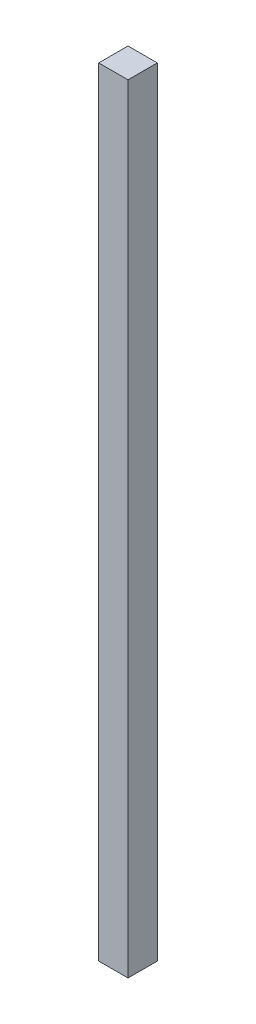
ISO-10303-21;
HEADER;
FILE_DESCRIPTION(('STEP AP214'),'2;1');
FILE_NAME('part.step','',(''),(''),'','','');
FILE_SCHEMA(('AUTOMOTIVE_DESIGN { 1 0 10303 214 1 1 1 1 }'));
ENDSEC;
DATA;
#1=APPLICATION_CONTEXT('core data for automotive mechanical design processes');
#2=APPLICATION_PROTOCOL_DEFINITION('international standard','automotive_design',2000,#1);
#3=PRODUCT_CONTEXT('',#1,'mechanical');
#4=PRODUCT('Part','Part','',(#3));
#5=PRODUCT_RELATED_PRODUCT_CATEGORY('part','',(#4));
#6=PRODUCT_DEFINITION_FORMATION('','',#4);
#7=PRODUCT_DEFINITION_CONTEXT('part definition',#1,'design');
#8=PRODUCT_DEFINITION('design','',#6,#7);
#9=PRODUCT_DEFINITION_SHAPE('','',#8);
#10=(LENGTH_UNIT() NAMED_UNIT(*) SI_UNIT(.MILLI.,.METRE.));
#11=(NAMED_UNIT(*) PLANE_ANGLE_UNIT() SI_UNIT($,.RADIAN.));
#12=(NAMED_UNIT(*) SI_UNIT($,.STERADIAN.) SOLID_ANGLE_UNIT());
#13=UNCERTAINTY_MEASURE_WITH_UNIT(LENGTH_MEASURE(1.E-05),#10,'distance_accuracy_value','');
#14=(GEOMETRIC_REPRESENTATION_CONTEXT(3) GLOBAL_UNCERTAINTY_ASSIGNED_CONTEXT((#13)) GLOBAL_UNIT_ASSIGNED_CONTEXT((#10,
#11,#12)) REPRESENTATION_CONTEXT('',''));
#15=CARTESIAN_POINT('',(0.,0.,0.));
#16=DIRECTION('',(0.,0.,1.));
#17=DIRECTION('',(1.,0.,0.));
#18=AXIS2_PLACEMENT_3D('',#15,#16,#17);
#19=CARTESIAN_POINT('',(0.,85.,-3.2));
#20=DIRECTION('',(0.,0.,-1.));
#21=DIRECTION('',(-1.,0.,0.));
#22=AXIS2_PLACEMENT_3D('',#19,#20,#21);
#23=PLANE('',#22);
#24=DIRECTION('',(1.,0.,0.));
#25=VECTOR('',#24,1.);
#26=CARTESIAN_POINT('',(0.,0.,-3.2));
#27=LINE('',#26,#25);
#28=CARTESIAN_POINT('',(0.,0.,-3.2));
#29=VERTEX_POINT('',#28);
#30=CARTESIAN_POINT('',(3.2,0.,-3.2));
#31=VERTEX_POINT('',#30);
#32=EDGE_CURVE('E116',#29,#31,#27,.T.);
#33=ORIENTED_EDGE('',*,*,#32,.F.);
#34=DIRECTION('',(0.,-1.,0.));
#35=VECTOR('',#34,1.);
#36=CARTESIAN_POINT('',(0.,85.,-3.2));
#37=LINE('',#36,#35);
#38=CARTESIAN_POINT('',(0.,85.,-3.2));
#39=VERTEX_POINT('',#38);
#40=EDGE_CURVE('E11',#39,#29,#37,.T.);
#41=ORIENTED_EDGE('',*,*,#40,.F.);
#42=DIRECTION('',(1.,0.,0.));
#43=VECTOR('',#42,1.);
#44=CARTESIAN_POINT('',(0.,85.,-3.2));
#45=LINE('',#44,#43);
#46=CARTESIAN_POINT('',(3.2,85.,-3.2));
#47=VERTEX_POINT('',#46);
#48=EDGE_CURVE('E109',#39,#47,#45,.T.);
#49=ORIENTED_EDGE('',*,*,#48,.T.);
#50=DIRECTION('',(0.,-1.,0.));
#51=VECTOR('',#50,1.);
#52=CARTESIAN_POINT('',(3.2,85.,-3.2));
#53=LINE('',#52,#51);
#54=EDGE_CURVE('E48',#47,#31,#53,.T.);
#55=ORIENTED_EDGE('',*,*,#54,.T.);
#56=EDGE_LOOP('',(#33,#41,#49,#55));
#57=FACE_BOUND('',#56,.T.);
#58=ADVANCED_FACE('F45',(#57),#23,.T.);
#59=CARTESIAN_POINT('',(0.,85.,-3.2));
#60=DIRECTION('',(1.,0.,0.));
#61=DIRECTION('',(0.,0.,-1.));
#62=AXIS2_PLACEMENT_3D('',#59,#60,#61);
#63=PLANE('',#62);
#64=DIRECTION('',(0.,0.,1.));
#65=VECTOR('',#64,1.);
#66=CARTESIAN_POINT('',(0.,0.,-3.2));
#67=LINE('',#66,#65);
#68=CARTESIAN_POINT('',(0.,0.,0.));
#69=VERTEX_POINT('',#68);
#70=EDGE_CURVE('E79',#29,#69,#67,.T.);
#71=ORIENTED_EDGE('',*,*,#70,.T.);
#72=DIRECTION('',(0.,-1.,0.));
#73=VECTOR('',#72,1.);
#74=CARTESIAN_POINT('',(0.,85.,0.));
#75=LINE('',#74,#73);
#76=CARTESIAN_POINT('',(0.,85.,0.));
#77=VERTEX_POINT('',#76);
#78=EDGE_CURVE('E55',#77,#69,#75,.T.);
#79=ORIENTED_EDGE('',*,*,#78,.F.);
#80=DIRECTION('',(0.,0.,1.));
#81=VECTOR('',#80,1.);
#82=CARTESIAN_POINT('',(0.,85.,-3.2));
#83=LINE('',#82,#81);
#84=EDGE_CURVE('E96',#39,#77,#83,.T.);
#85=ORIENTED_EDGE('',*,*,#84,.F.);
#86=ORIENTED_EDGE('',*,*,#40,.T.);
#87=EDGE_LOOP('',(#71,#79,#85,#86));
#88=FACE_BOUND('',#87,.T.);
#89=ADVANCED_FACE('F132',(#88),#63,.F.);
#90=CARTESIAN_POINT('',(0.,85.,0.));
#91=DIRECTION('',(0.,0.,-1.));
#92=DIRECTION('',(-1.,0.,0.));
#93=AXIS2_PLACEMENT_3D('',#90,#91,#92);
#94=PLANE('',#93);
#95=DIRECTION('',(1.,0.,0.));
#96=VECTOR('',#95,1.);
#97=CARTESIAN_POINT('',(0.,0.,0.));
#98=LINE('',#97,#96);
#99=CARTESIAN_POINT('',(3.2,0.,0.));
#100=VERTEX_POINT('',#99);
#101=EDGE_CURVE('E104',#69,#100,#98,.T.);
#102=ORIENTED_EDGE('',*,*,#101,.T.);
#103=DIRECTION('',(0.,-1.,0.));
#104=VECTOR('',#103,1.);
#105=CARTESIAN_POINT('',(3.2,85.,0.));
#106=LINE('',#105,#104);
#107=CARTESIAN_POINT('',(3.2,85.,0.));
#108=VERTEX_POINT('',#107);
#109=EDGE_CURVE('E101',#108,#100,#106,.T.);
#110=ORIENTED_EDGE('',*,*,#109,.F.);
#111=DIRECTION('',(1.,0.,0.));
#112=VECTOR('',#111,1.);
#113=CARTESIAN_POINT('',(0.,85.,0.));
#114=LINE('',#113,#112);
#115=EDGE_CURVE('E91',#77,#108,#114,.T.);
#116=ORIENTED_EDGE('',*,*,#115,.F.);
#117=ORIENTED_EDGE('',*,*,#78,.T.);
#118=EDGE_LOOP('',(#102,#110,#116,#117));
#119=FACE_BOUND('',#118,.T.);
#120=ADVANCED_FACE('F102',(#119),#94,.F.);
#121=CARTESIAN_POINT('',(3.2,85.,-3.2));
#122=DIRECTION('',(1.,0.,0.));
#123=DIRECTION('',(0.,0.,-1.));
#124=AXIS2_PLACEMENT_3D('',#121,#122,#123);
#125=PLANE('',#124);
#126=DIRECTION('',(0.,0.,1.));
#127=VECTOR('',#126,1.);
#128=CARTESIAN_POINT('',(3.2,0.,-3.2));
#129=LINE('',#128,#127);
#130=EDGE_CURVE('E120',#31,#100,#129,.T.);
#131=ORIENTED_EDGE('',*,*,#130,.F.);
#132=ORIENTED_EDGE('',*,*,#54,.F.);
#133=DIRECTION('',(0.,0.,1.));
#134=VECTOR('',#133,1.);
#135=CARTESIAN_POINT('',(3.2,85.,-3.2));
#136=LINE('',#135,#134);
#137=EDGE_CURVE('E95',#47,#108,#136,.T.);
#138=ORIENTED_EDGE('',*,*,#137,.T.);
#139=ORIENTED_EDGE('',*,*,#109,.T.);
#140=EDGE_LOOP('',(#131,#132,#138,#139));
#141=FACE_BOUND('',#140,.T.);
#142=ADVANCED_FACE('F107',(#141),#125,.T.);
#143=CARTESIAN_POINT('',(0.,85.,0.));
#144=DIRECTION('',(0.,-1.,0.));
#145=DIRECTION('',(0.,0.,-1.));
#146=AXIS2_PLACEMENT_3D('',#143,#144,#145);
#147=PLANE('',#146);
#148=ORIENTED_EDGE('',*,*,#48,.F.);
#149=ORIENTED_EDGE('',*,*,#84,.T.);
#150=ORIENTED_EDGE('',*,*,#115,.T.);
#151=ORIENTED_EDGE('',*,*,#137,.F.);
#152=EDGE_LOOP('',(#148,#149,#150,#151));
#153=FACE_BOUND('',#152,.T.);
#154=ADVANCED_FACE('F94',(#153),#147,.F.);
#155=CARTESIAN_POINT('',(0.,0.,0.));
#156=DIRECTION('',(0.,-1.,0.));
#157=DIRECTION('',(0.,0.,-1.));
#158=AXIS2_PLACEMENT_3D('',#155,#156,#157);
#159=PLANE('',#158);
#160=ORIENTED_EDGE('',*,*,#32,.T.);
#161=ORIENTED_EDGE('',*,*,#130,.T.);
#162=ORIENTED_EDGE('',*,*,#101,.F.);
#163=ORIENTED_EDGE('',*,*,#70,.F.);
#164=EDGE_LOOP('',(#160,#161,#162,#163));
#165=FACE_BOUND('',#164,.T.);
#166=ADVANCED_FACE('F129',(#165),#159,.T.);
#167=CLOSED_SHELL('',(#58,#89,#120,#142,#154,#166));
#168=MANIFOLD_SOLID_BREP('B2',#167);
#169=ADVANCED_BREP_SHAPE_REPRESENTATION('',(#18,#168),#14);
#170=SHAPE_DEFINITION_REPRESENTATION(#9,#169);
ENDSEC;
END-ISO-10303-21;
